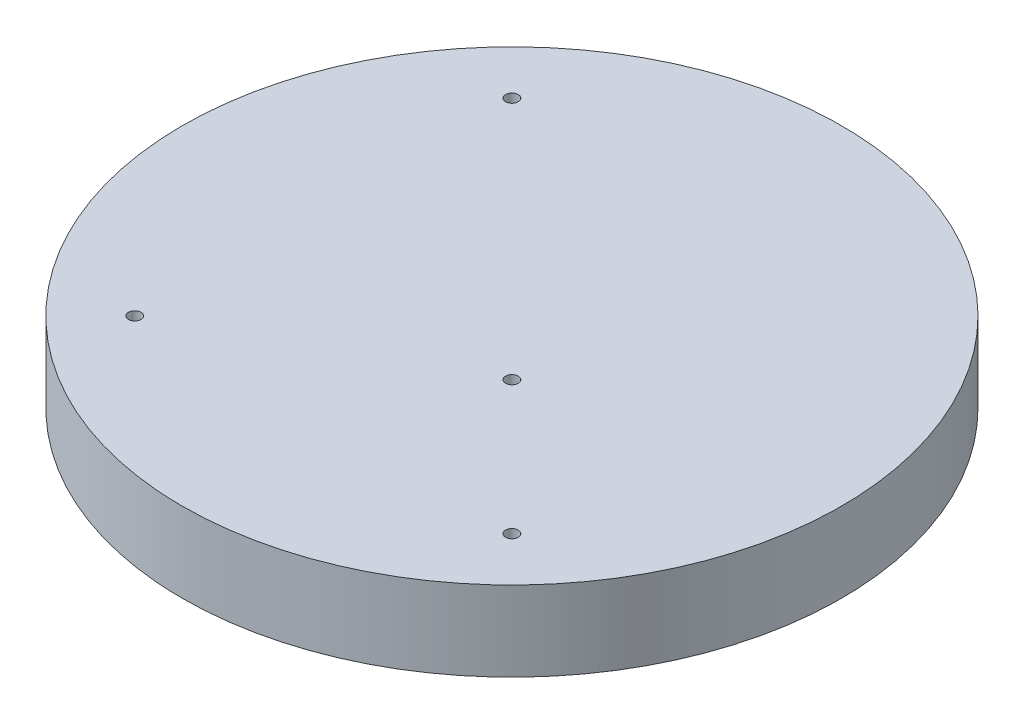
ISO-10303-21;
HEADER;
FILE_DESCRIPTION(('STEP AP214'),'2;1');
FILE_NAME('part.step','',(''),(''),'','','');
FILE_SCHEMA(('AUTOMOTIVE_DESIGN { 1 0 10303 214 1 1 1 1 }'));
ENDSEC;
DATA;
#1=APPLICATION_CONTEXT('core data for automotive mechanical design processes');
#2=APPLICATION_PROTOCOL_DEFINITION('international standard','automotive_design',2000,#1);
#3=PRODUCT_CONTEXT('',#1,'mechanical');
#4=PRODUCT('Part','Part','',(#3));
#5=PRODUCT_RELATED_PRODUCT_CATEGORY('part','',(#4));
#6=PRODUCT_DEFINITION_FORMATION('','',#4);
#7=PRODUCT_DEFINITION_CONTEXT('part definition',#1,'design');
#8=PRODUCT_DEFINITION('design','',#6,#7);
#9=PRODUCT_DEFINITION_SHAPE('','',#8);
#10=(LENGTH_UNIT() NAMED_UNIT(*) SI_UNIT(.MILLI.,.METRE.));
#11=(NAMED_UNIT(*) PLANE_ANGLE_UNIT() SI_UNIT($,.RADIAN.));
#12=(NAMED_UNIT(*) SI_UNIT($,.STERADIAN.) SOLID_ANGLE_UNIT());
#13=UNCERTAINTY_MEASURE_WITH_UNIT(LENGTH_MEASURE(1.E-05),#10,'distance_accuracy_value','');
#14=(GEOMETRIC_REPRESENTATION_CONTEXT(3) GLOBAL_UNCERTAINTY_ASSIGNED_CONTEXT((#13)) GLOBAL_UNIT_ASSIGNED_CONTEXT((#10,
#11,#12)) REPRESENTATION_CONTEXT('',''));
#15=CARTESIAN_POINT('',(0.,0.,0.));
#16=DIRECTION('',(0.,0.,1.));
#17=DIRECTION('',(1.,0.,0.));
#18=AXIS2_PLACEMENT_3D('',#15,#16,#17);
#19=CARTESIAN_POINT('',(0.,0.,0.));
#20=DIRECTION('',(0.,1.,0.));
#21=DIRECTION('',(0.,0.,1.));
#22=AXIS2_PLACEMENT_3D('',#19,#20,#21);
#23=PLANE('',#22);
#24=CARTESIAN_POINT('',(-30.,0.,30.));
#25=DIRECTION('',(0.,1.,0.));
#26=DIRECTION('',(0.,0.,1.));
#27=AXIS2_PLACEMENT_3D('',#24,#25,#26);
#28=CIRCLE('',#27,0.999999999999998);
#29=CARTESIAN_POINT('',(-30.,0.,31.));
#30=VERTEX_POINT('',#29);
#31=EDGE_CURVE('E58',#30,#30,#28,.T.);
#32=ORIENTED_EDGE('',*,*,#31,.T.);
#33=EDGE_LOOP('',(#32));
#34=FACE_BOUND('',#33,.T.);
#35=CARTESIAN_POINT('',(-30.,0.,-30.));
#36=DIRECTION('',(0.,1.,0.));
#37=DIRECTION('',(0.,0.,1.));
#38=AXIS2_PLACEMENT_3D('',#35,#36,#37);
#39=CIRCLE('',#38,0.999999999999998);
#40=CARTESIAN_POINT('',(-30.,0.,-29.));
#41=VERTEX_POINT('',#40);
#42=EDGE_CURVE('E46',#41,#41,#39,.T.);
#43=ORIENTED_EDGE('',*,*,#42,.T.);
#44=EDGE_LOOP('',(#43));
#45=FACE_BOUND('',#44,.T.);
#46=CARTESIAN_POINT('',(0.,0.,0.));
#47=DIRECTION('',(0.,1.,0.));
#48=DIRECTION('',(0.,0.,1.));
#49=AXIS2_PLACEMENT_3D('',#46,#47,#48);
#50=ELLIPSE('',#49,52.4264068711929,52.4264068711929);
#51=CARTESIAN_POINT('',(0.,0.,52.4264068711929));
#52=VERTEX_POINT('',#51);
#53=EDGE_CURVE('E39',#52,#52,#50,.T.);
#54=ORIENTED_EDGE('',*,*,#53,.F.);
#55=EDGE_LOOP('',(#54));
#56=FACE_BOUND('',#55,.T.);
#57=CARTESIAN_POINT('',(30.,0.,30.));
#58=DIRECTION('',(0.,1.,0.));
#59=DIRECTION('',(0.,0.,1.));
#60=AXIS2_PLACEMENT_3D('',#57,#58,#59);
#61=CIRCLE('',#60,0.999999999999998);
#62=CARTESIAN_POINT('',(30.,0.,31.));
#63=VERTEX_POINT('',#62);
#64=EDGE_CURVE('E52',#63,#63,#61,.T.);
#65=ORIENTED_EDGE('',*,*,#64,.T.);
#66=EDGE_LOOP('',(#65));
#67=FACE_BOUND('',#66,.T.);
#68=CARTESIAN_POINT('',(8.78679656440357,0.,8.78679656440358));
#69=DIRECTION('',(0.,1.,0.));
#70=DIRECTION('',(0.,0.,1.));
#71=AXIS2_PLACEMENT_3D('',#68,#69,#70);
#72=CIRCLE('',#71,1.);
#73=CARTESIAN_POINT('',(8.78679656440357,0.,9.78679656440358));
#74=VERTEX_POINT('',#73);
#75=EDGE_CURVE('E64',#74,#74,#72,.T.);
#76=ORIENTED_EDGE('',*,*,#75,.T.);
#77=EDGE_LOOP('',(#76));
#78=FACE_BOUND('',#77,.T.);
#79=ADVANCED_FACE('F31',(#34,#45,#56,#67,#78),#23,.F.);
#80=CARTESIAN_POINT('',(0.,12.7,0.));
#81=DIRECTION('',(0.,1.,0.));
#82=DIRECTION('',(0.,0.,1.));
#83=AXIS2_PLACEMENT_3D('',#80,#81,#82);
#84=PLANE('',#83);
#85=CARTESIAN_POINT('',(-30.,12.7,30.));
#86=DIRECTION('',(0.,1.,0.));
#87=DIRECTION('',(0.,0.,1.));
#88=AXIS2_PLACEMENT_3D('',#85,#86,#87);
#89=CIRCLE('',#88,0.999999999999998);
#90=CARTESIAN_POINT('',(-30.,12.7,31.));
#91=VERTEX_POINT('',#90);
#92=EDGE_CURVE('E55',#91,#91,#89,.T.);
#93=ORIENTED_EDGE('',*,*,#92,.F.);
#94=EDGE_LOOP('',(#93));
#95=FACE_BOUND('',#94,.T.);
#96=CARTESIAN_POINT('',(-30.,12.7,-30.));
#97=DIRECTION('',(0.,1.,0.));
#98=DIRECTION('',(0.,0.,1.));
#99=AXIS2_PLACEMENT_3D('',#96,#97,#98);
#100=CIRCLE('',#99,0.999999999999998);
#101=CARTESIAN_POINT('',(-30.,12.7,-29.));
#102=VERTEX_POINT('',#101);
#103=EDGE_CURVE('E43',#102,#102,#100,.T.);
#104=ORIENTED_EDGE('',*,*,#103,.F.);
#105=EDGE_LOOP('',(#104));
#106=FACE_BOUND('',#105,.T.);
#107=CARTESIAN_POINT('',(0.,12.7,0.));
#108=DIRECTION('',(0.,1.,0.));
#109=DIRECTION('',(0.,0.,1.));
#110=AXIS2_PLACEMENT_3D('',#107,#108,#109);
#111=ELLIPSE('',#110,52.4264068711929,52.4264068711929);
#112=CARTESIAN_POINT('',(0.,12.7,52.4264068711929));
#113=VERTEX_POINT('',#112);
#114=EDGE_CURVE('E10',#113,#113,#111,.T.);
#115=ORIENTED_EDGE('',*,*,#114,.T.);
#116=EDGE_LOOP('',(#115));
#117=FACE_BOUND('',#116,.T.);
#118=CARTESIAN_POINT('',(30.,12.7,30.));
#119=DIRECTION('',(0.,1.,0.));
#120=DIRECTION('',(0.,0.,1.));
#121=AXIS2_PLACEMENT_3D('',#118,#119,#120);
#122=CIRCLE('',#121,0.999999999999998);
#123=CARTESIAN_POINT('',(30.,12.7,31.));
#124=VERTEX_POINT('',#123);
#125=EDGE_CURVE('E49',#124,#124,#122,.T.);
#126=ORIENTED_EDGE('',*,*,#125,.F.);
#127=EDGE_LOOP('',(#126));
#128=FACE_BOUND('',#127,.T.);
#129=CARTESIAN_POINT('',(8.78679656440357,12.7,8.78679656440358));
#130=DIRECTION('',(0.,1.,0.));
#131=DIRECTION('',(0.,0.,1.));
#132=AXIS2_PLACEMENT_3D('',#129,#130,#131);
#133=CIRCLE('',#132,1.);
#134=CARTESIAN_POINT('',(8.78679656440357,12.7,9.78679656440358));
#135=VERTEX_POINT('',#134);
#136=EDGE_CURVE('E61',#135,#135,#133,.T.);
#137=ORIENTED_EDGE('',*,*,#136,.F.);
#138=EDGE_LOOP('',(#137));
#139=FACE_BOUND('',#138,.T.);
#140=ADVANCED_FACE('F33',(#95,#106,#117,#128,#139),#84,.T.);
#141=CARTESIAN_POINT('',(0.,160.984271247462,0.));
#142=DIRECTION('',(0.,1.,0.));
#143=DIRECTION('',(0.,0.,1.));
#144=AXIS2_PLACEMENT_3D('',#141,#142,#143);
#145=ELLIPSE('',#144,52.4264068711929,52.4264068711929);
#146=DIRECTION('',(0.,-1.,0.));
#147=VECTOR('',#146,1.);
#148=SURFACE_OF_LINEAR_EXTRUSION('',#145,#147);
#149=ORIENTED_EDGE('',*,*,#53,.T.);
#150=EDGE_LOOP('',(#149));
#151=FACE_BOUND('',#150,.T.);
#152=ORIENTED_EDGE('',*,*,#114,.F.);
#153=EDGE_LOOP('',(#152));
#154=FACE_BOUND('',#153,.T.);
#155=ADVANCED_FACE('F74',(#151,#154),#148,.F.);
#156=CARTESIAN_POINT('',(-30.,12.7,-30.));
#157=DIRECTION('',(0.,-1.,0.));
#158=DIRECTION('',(0.,0.,-1.));
#159=AXIS2_PLACEMENT_3D('',#156,#157,#158);
#160=CYLINDRICAL_SURFACE('',#159,0.999999999999998);
#161=ORIENTED_EDGE('',*,*,#103,.T.);
#162=EDGE_LOOP('',(#161));
#163=FACE_BOUND('',#162,.T.);
#164=ORIENTED_EDGE('',*,*,#42,.F.);
#165=EDGE_LOOP('',(#164));
#166=FACE_BOUND('',#165,.T.);
#167=ADVANCED_FACE('F80',(#163,#166),#160,.F.);
#168=CARTESIAN_POINT('',(30.,12.7,30.));
#169=DIRECTION('',(0.,-1.,0.));
#170=DIRECTION('',(0.,0.,-1.));
#171=AXIS2_PLACEMENT_3D('',#168,#169,#170);
#172=CYLINDRICAL_SURFACE('',#171,0.999999999999998);
#173=ORIENTED_EDGE('',*,*,#125,.T.);
#174=EDGE_LOOP('',(#173));
#175=FACE_BOUND('',#174,.T.);
#176=ORIENTED_EDGE('',*,*,#64,.F.);
#177=EDGE_LOOP('',(#176));
#178=FACE_BOUND('',#177,.T.);
#179=ADVANCED_FACE('F90',(#175,#178),#172,.F.);
#180=CARTESIAN_POINT('',(-30.,12.7,30.));
#181=DIRECTION('',(0.,-1.,0.));
#182=DIRECTION('',(0.,0.,-1.));
#183=AXIS2_PLACEMENT_3D('',#180,#181,#182);
#184=CYLINDRICAL_SURFACE('',#183,0.999999999999998);
#185=ORIENTED_EDGE('',*,*,#92,.T.);
#186=EDGE_LOOP('',(#185));
#187=FACE_BOUND('',#186,.T.);
#188=ORIENTED_EDGE('',*,*,#31,.F.);
#189=EDGE_LOOP('',(#188));
#190=FACE_BOUND('',#189,.T.);
#191=ADVANCED_FACE('F93',(#187,#190),#184,.F.);
#192=CARTESIAN_POINT('',(8.78679656440357,12.7,8.78679656440358));
#193=DIRECTION('',(0.,-1.,0.));
#194=DIRECTION('',(0.,0.,-1.));
#195=AXIS2_PLACEMENT_3D('',#192,#193,#194);
#196=CYLINDRICAL_SURFACE('',#195,1.);
#197=ORIENTED_EDGE('',*,*,#136,.T.);
#198=EDGE_LOOP('',(#197));
#199=FACE_BOUND('',#198,.T.);
#200=ORIENTED_EDGE('',*,*,#75,.F.);
#201=EDGE_LOOP('',(#200));
#202=FACE_BOUND('',#201,.T.);
#203=ADVANCED_FACE('F70',(#199,#202),#196,.F.);
#204=CLOSED_SHELL('',(#79,#140,#155,#167,#179,#191,#203));
#205=MANIFOLD_SOLID_BREP('B2',#204);
#206=ADVANCED_BREP_SHAPE_REPRESENTATION('',(#18,#205),#14);
#207=SHAPE_DEFINITION_REPRESENTATION(#9,#206);
ENDSEC;
END-ISO-10303-21;
